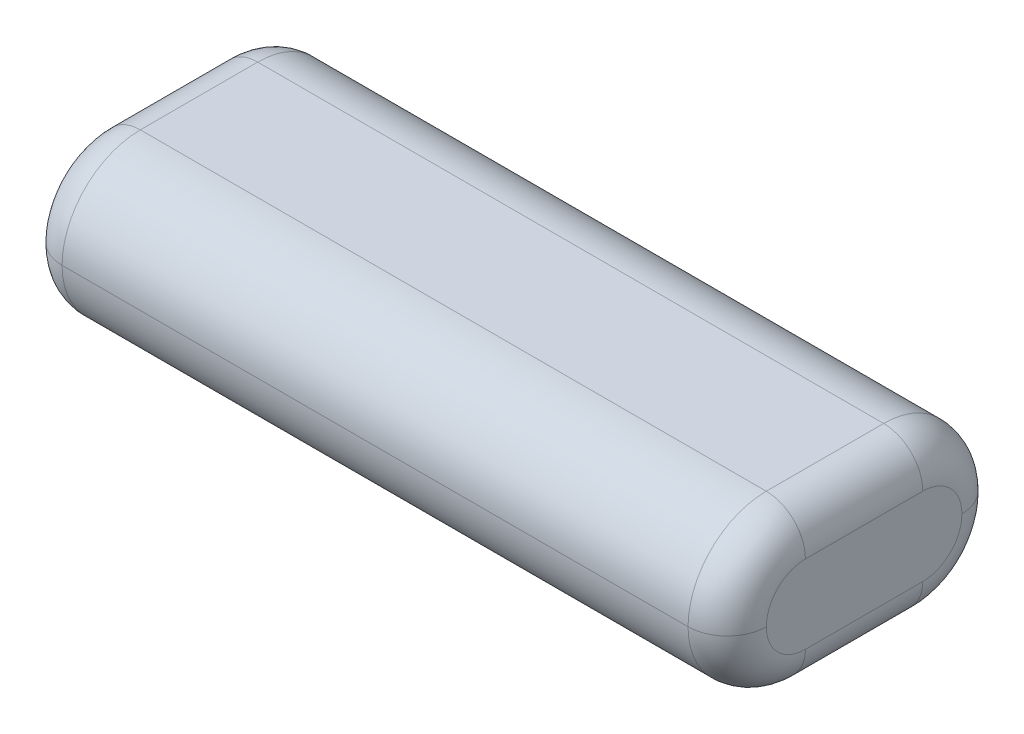
ISO-10303-21;
HEADER;
FILE_DESCRIPTION(('STEP AP214'),'2;1');
FILE_NAME('part.step','',(''),(''),'','','');
FILE_SCHEMA(('AUTOMOTIVE_DESIGN { 1 0 10303 214 1 1 1 1 }'));
ENDSEC;
DATA;
#1=APPLICATION_CONTEXT('core data for automotive mechanical design processes');
#2=APPLICATION_PROTOCOL_DEFINITION('international standard','automotive_design',2000,#1);
#3=PRODUCT_CONTEXT('',#1,'mechanical');
#4=PRODUCT('Part','Part','',(#3));
#5=PRODUCT_RELATED_PRODUCT_CATEGORY('part','',(#4));
#6=PRODUCT_DEFINITION_FORMATION('','',#4);
#7=PRODUCT_DEFINITION_CONTEXT('part definition',#1,'design');
#8=PRODUCT_DEFINITION('design','',#6,#7);
#9=PRODUCT_DEFINITION_SHAPE('','',#8);
#10=(LENGTH_UNIT() NAMED_UNIT(*) SI_UNIT(.MILLI.,.METRE.));
#11=(NAMED_UNIT(*) PLANE_ANGLE_UNIT() SI_UNIT($,.RADIAN.));
#12=(NAMED_UNIT(*) SI_UNIT($,.STERADIAN.) SOLID_ANGLE_UNIT());
#13=UNCERTAINTY_MEASURE_WITH_UNIT(LENGTH_MEASURE(1.E-05),#10,'distance_accuracy_value','');
#14=(GEOMETRIC_REPRESENTATION_CONTEXT(3) GLOBAL_UNCERTAINTY_ASSIGNED_CONTEXT((#13)) GLOBAL_UNIT_ASSIGNED_CONTEXT((#10,
#11,#12)) REPRESENTATION_CONTEXT('',''));
#15=CARTESIAN_POINT('',(0.,0.,0.));
#16=DIRECTION('',(0.,0.,1.));
#17=DIRECTION('',(1.,0.,0.));
#18=AXIS2_PLACEMENT_3D('',#15,#16,#17);
#19=CARTESIAN_POINT('',(0.,20.,0.));
#20=DIRECTION('',(1.,0.,0.));
#21=DIRECTION('',(0.,0.,-1.));
#22=AXIS2_PLACEMENT_3D('',#19,#20,#21);
#23=PLANE('',#22);
#24=DIRECTION('',(0.,0.,1.));
#25=VECTOR('',#24,1.);
#26=CARTESIAN_POINT('',(0.,15.,0.));
#27=LINE('',#26,#25);
#28=CARTESIAN_POINT('',(0.,15.,-10.));
#29=VERTEX_POINT('',#28);
#30=CARTESIAN_POINT('',(0.,15.,-25.));
#31=VERTEX_POINT('',#30);
#32=EDGE_CURVE('E137',#29,#31,#27,.F.);
#33=ORIENTED_EDGE('',*,*,#32,.T.);
#34=CARTESIAN_POINT('',(0.,10.,-25.));
#35=DIRECTION('',(1.,0.,0.));
#36=DIRECTION('',(0.,0.,-1.));
#37=AXIS2_PLACEMENT_3D('',#34,#35,#36);
#38=CIRCLE('',#37,5.);
#39=CARTESIAN_POINT('',(0.,10.,-30.));
#40=VERTEX_POINT('',#39);
#41=EDGE_CURVE('E179',#31,#40,#38,.F.);
#42=ORIENTED_EDGE('',*,*,#41,.T.);
#43=CARTESIAN_POINT('',(0.,10.,-25.));
#44=DIRECTION('',(1.,0.,0.));
#45=DIRECTION('',(0.,0.,-1.));
#46=AXIS2_PLACEMENT_3D('',#43,#44,#45);
#47=CIRCLE('',#46,5.);
#48=CARTESIAN_POINT('',(0.,5.,-25.));
#49=VERTEX_POINT('',#48);
#50=EDGE_CURVE('E176',#40,#49,#47,.F.);
#51=ORIENTED_EDGE('',*,*,#50,.T.);
#52=DIRECTION('',(0.,0.,1.));
#53=VECTOR('',#52,1.);
#54=CARTESIAN_POINT('',(0.,5.,-10.));
#55=LINE('',#54,#53);
#56=CARTESIAN_POINT('',(0.,5.,-10.));
#57=VERTEX_POINT('',#56);
#58=EDGE_CURVE('E173',#49,#57,#55,.T.);
#59=ORIENTED_EDGE('',*,*,#58,.T.);
#60=CARTESIAN_POINT('',(0.,10.,-10.));
#61=DIRECTION('',(1.,0.,0.));
#62=DIRECTION('',(0.,0.,-1.));
#63=AXIS2_PLACEMENT_3D('',#60,#61,#62);
#64=CIRCLE('',#63,5.);
#65=CARTESIAN_POINT('',(0.,10.,-5.));
#66=VERTEX_POINT('',#65);
#67=EDGE_CURVE('E140',#57,#66,#64,.F.);
#68=ORIENTED_EDGE('',*,*,#67,.T.);
#69=CARTESIAN_POINT('',(0.,10.,-10.));
#70=DIRECTION('',(1.,0.,0.));
#71=DIRECTION('',(0.,0.,-1.));
#72=AXIS2_PLACEMENT_3D('',#69,#70,#71);
#73=CIRCLE('',#72,5.);
#74=EDGE_CURVE('E133',#66,#29,#73,.F.);
#75=ORIENTED_EDGE('',*,*,#74,.T.);
#76=EDGE_LOOP('',(#33,#42,#51,#59,#68,#75));
#77=FACE_BOUND('',#76,.T.);
#78=ADVANCED_FACE('F41',(#77),#23,.F.);
#79=CARTESIAN_POINT('',(90.,20.,0.));
#80=DIRECTION('',(-1.,0.,0.));
#81=DIRECTION('',(0.,0.,1.));
#82=AXIS2_PLACEMENT_3D('',#79,#80,#81);
#83=PLANE('',#82);
#84=DIRECTION('',(0.,0.,-1.));
#85=VECTOR('',#84,1.);
#86=CARTESIAN_POINT('',(90.,15.,0.));
#87=LINE('',#86,#85);
#88=CARTESIAN_POINT('',(90.,15.,-25.));
#89=VERTEX_POINT('',#88);
#90=CARTESIAN_POINT('',(90.,15.,-10.));
#91=VERTEX_POINT('',#90);
#92=EDGE_CURVE('E213',#89,#91,#87,.F.);
#93=ORIENTED_EDGE('',*,*,#92,.T.);
#94=CARTESIAN_POINT('',(90.,10.,-10.));
#95=DIRECTION('',(-1.,0.,0.));
#96=DIRECTION('',(0.,0.,1.));
#97=AXIS2_PLACEMENT_3D('',#94,#95,#96);
#98=CIRCLE('',#97,5.);
#99=CARTESIAN_POINT('',(90.,10.,-5.));
#100=VERTEX_POINT('',#99);
#101=EDGE_CURVE('E227',#91,#100,#98,.F.);
#102=ORIENTED_EDGE('',*,*,#101,.T.);
#103=CARTESIAN_POINT('',(90.,10.,-10.));
#104=DIRECTION('',(-1.,0.,0.));
#105=DIRECTION('',(0.,0.,1.));
#106=AXIS2_PLACEMENT_3D('',#103,#104,#105);
#107=CIRCLE('',#106,5.);
#108=CARTESIAN_POINT('',(90.,5.,-10.));
#109=VERTEX_POINT('',#108);
#110=EDGE_CURVE('E66',#100,#109,#107,.F.);
#111=ORIENTED_EDGE('',*,*,#110,.T.);
#112=DIRECTION('',(0.,0.,-1.));
#113=VECTOR('',#112,1.);
#114=CARTESIAN_POINT('',(90.,5.,-25.));
#115=LINE('',#114,#113);
#116=CARTESIAN_POINT('',(90.,5.,-25.));
#117=VERTEX_POINT('',#116);
#118=EDGE_CURVE('E222',#109,#117,#115,.T.);
#119=ORIENTED_EDGE('',*,*,#118,.T.);
#120=CARTESIAN_POINT('',(90.,10.,-25.));
#121=DIRECTION('',(-1.,0.,0.));
#122=DIRECTION('',(0.,0.,1.));
#123=AXIS2_PLACEMENT_3D('',#120,#121,#122);
#124=CIRCLE('',#123,5.);
#125=CARTESIAN_POINT('',(90.,10.,-30.));
#126=VERTEX_POINT('',#125);
#127=EDGE_CURVE('E219',#117,#126,#124,.F.);
#128=ORIENTED_EDGE('',*,*,#127,.T.);
#129=CARTESIAN_POINT('',(90.,10.,-25.));
#130=DIRECTION('',(-1.,0.,0.));
#131=DIRECTION('',(0.,0.,1.));
#132=AXIS2_PLACEMENT_3D('',#129,#130,#131);
#133=CIRCLE('',#132,5.);
#134=EDGE_CURVE('E216',#126,#89,#133,.F.);
#135=ORIENTED_EDGE('',*,*,#134,.T.);
#136=EDGE_LOOP('',(#93,#102,#111,#119,#128,#135));
#137=FACE_BOUND('',#136,.T.);
#138=ADVANCED_FACE('F337',(#137),#83,.F.);
#139=CARTESIAN_POINT('',(0.,20.,0.));
#140=DIRECTION('',(0.,-1.,0.));
#141=DIRECTION('',(0.,0.,-1.));
#142=AXIS2_PLACEMENT_3D('',#139,#140,#141);
#143=PLANE('',#142);
#144=DIRECTION('',(-1.,0.,0.));
#145=VECTOR('',#144,1.);
#146=CARTESIAN_POINT('',(0.,20.,-25.));
#147=LINE('',#146,#145);
#148=CARTESIAN_POINT('',(85.,20.,-25.));
#149=VERTEX_POINT('',#148);
#150=CARTESIAN_POINT('',(5.,20.,-25.));
#151=VERTEX_POINT('',#150);
#152=EDGE_CURVE('E309',#149,#151,#147,.T.);
#153=ORIENTED_EDGE('',*,*,#152,.T.);
#154=DIRECTION('',(0.,0.,1.));
#155=VECTOR('',#154,1.);
#156=CARTESIAN_POINT('',(5.,20.,0.));
#157=LINE('',#156,#155);
#158=CARTESIAN_POINT('',(5.,20.,-10.));
#159=VERTEX_POINT('',#158);
#160=EDGE_CURVE('E11',#151,#159,#157,.T.);
#161=ORIENTED_EDGE('',*,*,#160,.T.);
#162=DIRECTION('',(1.,0.,0.));
#163=VECTOR('',#162,1.);
#164=CARTESIAN_POINT('',(0.,20.,-10.));
#165=LINE('',#164,#163);
#166=CARTESIAN_POINT('',(85.,20.,-10.));
#167=VERTEX_POINT('',#166);
#168=EDGE_CURVE('E302',#159,#167,#165,.T.);
#169=ORIENTED_EDGE('',*,*,#168,.T.);
#170=DIRECTION('',(0.,0.,-1.));
#171=VECTOR('',#170,1.);
#172=CARTESIAN_POINT('',(85.,20.,0.));
#173=LINE('',#172,#171);
#174=EDGE_CURVE('E51',#167,#149,#173,.T.);
#175=ORIENTED_EDGE('',*,*,#174,.T.);
#176=EDGE_LOOP('',(#153,#161,#169,#175));
#177=FACE_BOUND('',#176,.T.);
#178=ADVANCED_FACE('F308',(#177),#143,.F.);
#179=CARTESIAN_POINT('',(0.,0.,0.));
#180=DIRECTION('',(0.,-1.,0.));
#181=DIRECTION('',(0.,0.,-1.));
#182=AXIS2_PLACEMENT_3D('',#179,#180,#181);
#183=PLANE('',#182);
#184=DIRECTION('',(1.,0.,0.));
#185=VECTOR('',#184,1.);
#186=CARTESIAN_POINT('',(0.,0.,-10.));
#187=LINE('',#186,#185);
#188=CARTESIAN_POINT('',(85.,0.,-10.));
#189=VERTEX_POINT('',#188);
#190=CARTESIAN_POINT('',(5.,0.,-10.));
#191=VERTEX_POINT('',#190);
#192=EDGE_CURVE('E165',#189,#191,#187,.F.);
#193=ORIENTED_EDGE('',*,*,#192,.T.);
#194=DIRECTION('',(0.,0.,1.));
#195=VECTOR('',#194,1.);
#196=CARTESIAN_POINT('',(5.,0.,-25.));
#197=LINE('',#196,#195);
#198=CARTESIAN_POINT('',(5.,0.,-25.));
#199=VERTEX_POINT('',#198);
#200=EDGE_CURVE('E198',#191,#199,#197,.F.);
#201=ORIENTED_EDGE('',*,*,#200,.T.);
#202=DIRECTION('',(-1.,0.,0.));
#203=VECTOR('',#202,1.);
#204=CARTESIAN_POINT('',(90.,0.,-25.));
#205=LINE('',#204,#203);
#206=CARTESIAN_POINT('',(85.,0.,-25.));
#207=VERTEX_POINT('',#206);
#208=EDGE_CURVE('E161',#199,#207,#205,.F.);
#209=ORIENTED_EDGE('',*,*,#208,.T.);
#210=DIRECTION('',(0.,0.,-1.));
#211=VECTOR('',#210,1.);
#212=CARTESIAN_POINT('',(85.,0.,-10.));
#213=LINE('',#212,#211);
#214=EDGE_CURVE('E195',#207,#189,#213,.F.);
#215=ORIENTED_EDGE('',*,*,#214,.T.);
#216=EDGE_LOOP('',(#193,#201,#209,#215));
#217=FACE_BOUND('',#216,.T.);
#218=ADVANCED_FACE('F284',(#217),#183,.T.);
#219=CARTESIAN_POINT('',(0.,10.,-25.));
#220=DIRECTION('',(1.,0.,0.));
#221=DIRECTION('',(0.,0.,-1.));
#222=AXIS2_PLACEMENT_3D('',#219,#220,#221);
#223=CYLINDRICAL_SURFACE('',#222,10.);
#224=ORIENTED_EDGE('',*,*,#208,.F.);
#225=CARTESIAN_POINT('',(5.,10.,-25.));
#226=DIRECTION('',(1.,0.,0.));
#227=DIRECTION('',(0.,0.,-1.));
#228=AXIS2_PLACEMENT_3D('',#225,#226,#227);
#229=CIRCLE('',#228,10.);
#230=CARTESIAN_POINT('',(5.,10.,-35.));
#231=VERTEX_POINT('',#230);
#232=EDGE_CURVE('E192',#199,#231,#229,.T.);
#233=ORIENTED_EDGE('',*,*,#232,.T.);
#234=DIRECTION('',(-1.,0.,0.));
#235=VECTOR('',#234,1.);
#236=CARTESIAN_POINT('',(0.,10.,-35.));
#237=LINE('',#236,#235);
#238=CARTESIAN_POINT('',(85.,10.,-35.));
#239=VERTEX_POINT('',#238);
#240=EDGE_CURVE('E281',#239,#231,#237,.T.);
#241=ORIENTED_EDGE('',*,*,#240,.F.);
#242=CARTESIAN_POINT('',(85.,10.,-25.));
#243=DIRECTION('',(-1.,0.,0.));
#244=DIRECTION('',(0.,0.,1.));
#245=AXIS2_PLACEMENT_3D('',#242,#243,#244);
#246=CIRCLE('',#245,10.);
#247=EDGE_CURVE('E189',#239,#207,#246,.T.);
#248=ORIENTED_EDGE('',*,*,#247,.T.);
#249=EDGE_LOOP('',(#224,#233,#241,#248));
#250=FACE_BOUND('',#249,.T.);
#251=ADVANCED_FACE('F278',(#250),#223,.T.);
#252=CARTESIAN_POINT('',(0.,10.,-25.));
#253=DIRECTION('',(-1.,0.,0.));
#254=DIRECTION('',(0.,0.,1.));
#255=AXIS2_PLACEMENT_3D('',#252,#253,#254);
#256=CYLINDRICAL_SURFACE('',#255,10.);
#257=ORIENTED_EDGE('',*,*,#240,.T.);
#258=CARTESIAN_POINT('',(5.,10.,-25.));
#259=DIRECTION('',(1.,0.,0.));
#260=DIRECTION('',(0.,0.,-1.));
#261=AXIS2_PLACEMENT_3D('',#258,#259,#260);
#262=CIRCLE('',#261,10.);
#263=EDGE_CURVE('E185',#231,#151,#262,.T.);
#264=ORIENTED_EDGE('',*,*,#263,.T.);
#265=ORIENTED_EDGE('',*,*,#152,.F.);
#266=CARTESIAN_POINT('',(85.,10.,-25.));
#267=DIRECTION('',(-1.,0.,0.));
#268=DIRECTION('',(0.,0.,1.));
#269=AXIS2_PLACEMENT_3D('',#266,#267,#268);
#270=CIRCLE('',#269,10.);
#271=EDGE_CURVE('E182',#149,#239,#270,.T.);
#272=ORIENTED_EDGE('',*,*,#271,.T.);
#273=EDGE_LOOP('',(#257,#264,#265,#272));
#274=FACE_BOUND('',#273,.T.);
#275=ADVANCED_FACE('F298',(#274),#256,.T.);
#276=CARTESIAN_POINT('',(0.,10.,-10.));
#277=DIRECTION('',(1.,0.,0.));
#278=DIRECTION('',(0.,0.,-1.));
#279=AXIS2_PLACEMENT_3D('',#276,#277,#278);
#280=CYLINDRICAL_SURFACE('',#279,10.);
#281=ORIENTED_EDGE('',*,*,#168,.F.);
#282=CARTESIAN_POINT('',(5.,10.,-10.));
#283=DIRECTION('',(1.,0.,0.));
#284=DIRECTION('',(0.,0.,-1.));
#285=AXIS2_PLACEMENT_3D('',#282,#283,#284);
#286=CIRCLE('',#285,10.);
#287=CARTESIAN_POINT('',(5.,10.,0.));
#288=VERTEX_POINT('',#287);
#289=EDGE_CURVE('E150',#159,#288,#286,.T.);
#290=ORIENTED_EDGE('',*,*,#289,.T.);
#291=DIRECTION('',(1.,0.,0.));
#292=VECTOR('',#291,1.);
#293=CARTESIAN_POINT('',(0.,10.,0.));
#294=LINE('',#293,#292);
#295=CARTESIAN_POINT('',(85.,10.,0.));
#296=VERTEX_POINT('',#295);
#297=EDGE_CURVE('E168',#296,#288,#294,.F.);
#298=ORIENTED_EDGE('',*,*,#297,.F.);
#299=CARTESIAN_POINT('',(85.,10.,-10.));
#300=DIRECTION('',(-1.,0.,0.));
#301=DIRECTION('',(0.,0.,1.));
#302=AXIS2_PLACEMENT_3D('',#299,#300,#301);
#303=CIRCLE('',#302,10.);
#304=EDGE_CURVE('E207',#296,#167,#303,.T.);
#305=ORIENTED_EDGE('',*,*,#304,.T.);
#306=EDGE_LOOP('',(#281,#290,#298,#305));
#307=FACE_BOUND('',#306,.T.);
#308=ADVANCED_FACE('F311',(#307),#280,.T.);
#309=CARTESIAN_POINT('',(0.,10.,-10.));
#310=DIRECTION('',(-1.,0.,0.));
#311=DIRECTION('',(0.,0.,1.));
#312=AXIS2_PLACEMENT_3D('',#309,#310,#311);
#313=CYLINDRICAL_SURFACE('',#312,10.);
#314=ORIENTED_EDGE('',*,*,#297,.T.);
#315=CARTESIAN_POINT('',(5.,10.,-10.));
#316=DIRECTION('',(1.,0.,0.));
#317=DIRECTION('',(0.,0.,-1.));
#318=AXIS2_PLACEMENT_3D('',#315,#316,#317);
#319=CIRCLE('',#318,10.);
#320=EDGE_CURVE('E204',#288,#191,#319,.T.);
#321=ORIENTED_EDGE('',*,*,#320,.T.);
#322=ORIENTED_EDGE('',*,*,#192,.F.);
#323=CARTESIAN_POINT('',(85.,10.,-10.));
#324=DIRECTION('',(-1.,0.,0.));
#325=DIRECTION('',(0.,0.,1.));
#326=AXIS2_PLACEMENT_3D('',#323,#324,#325);
#327=CIRCLE('',#326,10.);
#328=EDGE_CURVE('E201',#189,#296,#327,.T.);
#329=ORIENTED_EDGE('',*,*,#328,.T.);
#330=EDGE_LOOP('',(#314,#321,#322,#329));
#331=FACE_BOUND('',#330,.T.);
#332=ADVANCED_FACE('F323',(#331),#313,.T.);
#333=CARTESIAN_POINT('',(5.,10.,-10.));
#334=DIRECTION('',(1.,0.,0.));
#335=DIRECTION('',(0.,0.,-1.));
#336=AXIS2_PLACEMENT_3D('',#333,#334,#335);
#337=DEGENERATE_TOROIDAL_SURFACE('',#336,5.,5.,.T.);
#338=CARTESIAN_POINT('',(5.,5.,-10.));
#339=DIRECTION('',(0.,0.,-1.));
#340=DIRECTION('',(-1.,0.,0.));
#341=AXIS2_PLACEMENT_3D('',#338,#339,#340);
#342=CIRCLE('',#341,5.);
#343=EDGE_CURVE('E154',#191,#57,#342,.T.);
#344=ORIENTED_EDGE('',*,*,#343,.F.);
#345=ORIENTED_EDGE('',*,*,#320,.F.);
#346=CARTESIAN_POINT('',(5.,10.,-5.));
#347=DIRECTION('',(0.,1.,0.));
#348=DIRECTION('',(0.,0.,1.));
#349=AXIS2_PLACEMENT_3D('',#346,#347,#348);
#350=CIRCLE('',#349,5.);
#351=EDGE_CURVE('E243',#66,#288,#350,.T.);
#352=ORIENTED_EDGE('',*,*,#351,.F.);
#353=ORIENTED_EDGE('',*,*,#67,.F.);
#354=EDGE_LOOP('',(#344,#345,#352,#353));
#355=FACE_BOUND('',#354,.T.);
#356=ADVANCED_FACE('F326',(#355),#337,.T.);
#357=CARTESIAN_POINT('',(5.,10.,-10.));
#358=DIRECTION('',(1.,0.,0.));
#359=DIRECTION('',(0.,0.,-1.));
#360=AXIS2_PLACEMENT_3D('',#357,#358,#359);
#361=DEGENERATE_TOROIDAL_SURFACE('',#360,5.,5.,.T.);
#362=ORIENTED_EDGE('',*,*,#351,.T.);
#363=ORIENTED_EDGE('',*,*,#289,.F.);
#364=CARTESIAN_POINT('',(5.,15.,-10.));
#365=DIRECTION('',(0.,0.,-1.));
#366=DIRECTION('',(-1.,0.,0.));
#367=AXIS2_PLACEMENT_3D('',#364,#365,#366);
#368=CIRCLE('',#367,5.);
#369=EDGE_CURVE('E148',#29,#159,#368,.T.);
#370=ORIENTED_EDGE('',*,*,#369,.F.);
#371=ORIENTED_EDGE('',*,*,#74,.F.);
#372=EDGE_LOOP('',(#362,#363,#370,#371));
#373=FACE_BOUND('',#372,.T.);
#374=ADVANCED_FACE('F149',(#373),#361,.T.);
#375=CARTESIAN_POINT('',(5.,5.,0.));
#376=DIRECTION('',(0.,0.,-1.));
#377=DIRECTION('',(-1.,0.,0.));
#378=AXIS2_PLACEMENT_3D('',#375,#376,#377);
#379=CYLINDRICAL_SURFACE('',#378,5.);
#380=ORIENTED_EDGE('',*,*,#343,.T.);
#381=ORIENTED_EDGE('',*,*,#58,.F.);
#382=CARTESIAN_POINT('',(5.,5.,-25.));
#383=DIRECTION('',(0.,0.,-1.));
#384=DIRECTION('',(-1.,0.,0.));
#385=AXIS2_PLACEMENT_3D('',#382,#383,#384);
#386=CIRCLE('',#385,5.);
#387=EDGE_CURVE('E155',#199,#49,#386,.T.);
#388=ORIENTED_EDGE('',*,*,#387,.F.);
#389=ORIENTED_EDGE('',*,*,#200,.F.);
#390=EDGE_LOOP('',(#380,#381,#388,#389));
#391=FACE_BOUND('',#390,.T.);
#392=ADVANCED_FACE('F289',(#391),#379,.T.);
#393=CARTESIAN_POINT('',(5.,15.,0.));
#394=DIRECTION('',(0.,0.,1.));
#395=DIRECTION('',(1.,0.,0.));
#396=AXIS2_PLACEMENT_3D('',#393,#394,#395);
#397=CYLINDRICAL_SURFACE('',#396,5.);
#398=ORIENTED_EDGE('',*,*,#369,.T.);
#399=ORIENTED_EDGE('',*,*,#160,.F.);
#400=CARTESIAN_POINT('',(5.,15.,-25.));
#401=DIRECTION('',(0.,0.,-1.));
#402=DIRECTION('',(-1.,0.,0.));
#403=AXIS2_PLACEMENT_3D('',#400,#401,#402);
#404=CIRCLE('',#403,5.);
#405=EDGE_CURVE('E158',#31,#151,#404,.T.);
#406=ORIENTED_EDGE('',*,*,#405,.F.);
#407=ORIENTED_EDGE('',*,*,#32,.F.);
#408=EDGE_LOOP('',(#398,#399,#406,#407));
#409=FACE_BOUND('',#408,.T.);
#410=ADVANCED_FACE('F157',(#409),#397,.T.);
#411=CARTESIAN_POINT('',(5.,10.,-25.));
#412=DIRECTION('',(1.,0.,0.));
#413=DIRECTION('',(0.,0.,-1.));
#414=AXIS2_PLACEMENT_3D('',#411,#412,#413);
#415=DEGENERATE_TOROIDAL_SURFACE('',#414,5.,5.,.T.);
#416=ORIENTED_EDGE('',*,*,#387,.T.);
#417=ORIENTED_EDGE('',*,*,#50,.F.);
#418=CARTESIAN_POINT('',(5.,10.,-30.));
#419=DIRECTION('',(0.,1.,0.));
#420=DIRECTION('',(0.,0.,1.));
#421=AXIS2_PLACEMENT_3D('',#418,#419,#420);
#422=CIRCLE('',#421,5.);
#423=EDGE_CURVE('E232',#231,#40,#422,.T.);
#424=ORIENTED_EDGE('',*,*,#423,.F.);
#425=ORIENTED_EDGE('',*,*,#232,.F.);
#426=EDGE_LOOP('',(#416,#417,#424,#425));
#427=FACE_BOUND('',#426,.T.);
#428=ADVANCED_FACE('F295',(#427),#415,.T.);
#429=CARTESIAN_POINT('',(5.,10.,-25.));
#430=DIRECTION('',(1.,0.,0.));
#431=DIRECTION('',(0.,0.,-1.));
#432=AXIS2_PLACEMENT_3D('',#429,#430,#431);
#433=DEGENERATE_TOROIDAL_SURFACE('',#432,5.,5.,.T.);
#434=ORIENTED_EDGE('',*,*,#405,.T.);
#435=ORIENTED_EDGE('',*,*,#263,.F.);
#436=ORIENTED_EDGE('',*,*,#423,.T.);
#437=ORIENTED_EDGE('',*,*,#41,.F.);
#438=EDGE_LOOP('',(#434,#435,#436,#437));
#439=FACE_BOUND('',#438,.T.);
#440=ADVANCED_FACE('F304',(#439),#433,.T.);
#441=CARTESIAN_POINT('',(85.,10.,-25.));
#442=DIRECTION('',(-1.,0.,0.));
#443=DIRECTION('',(0.,0.,1.));
#444=AXIS2_PLACEMENT_3D('',#441,#442,#443);
#445=DEGENERATE_TOROIDAL_SURFACE('',#444,5.,5.,.T.);
#446=CARTESIAN_POINT('',(85.,5.,-25.));
#447=DIRECTION('',(0.,0.,1.));
#448=DIRECTION('',(1.,0.,0.));
#449=AXIS2_PLACEMENT_3D('',#446,#447,#448);
#450=CIRCLE('',#449,5.);
#451=EDGE_CURVE('E258',#207,#117,#450,.T.);
#452=ORIENTED_EDGE('',*,*,#451,.F.);
#453=ORIENTED_EDGE('',*,*,#247,.F.);
#454=CARTESIAN_POINT('',(85.,10.,-30.));
#455=DIRECTION('',(0.,1.,0.));
#456=DIRECTION('',(0.,0.,1.));
#457=AXIS2_PLACEMENT_3D('',#454,#455,#456);
#458=CIRCLE('',#457,5.);
#459=EDGE_CURVE('E45',#126,#239,#458,.T.);
#460=ORIENTED_EDGE('',*,*,#459,.F.);
#461=ORIENTED_EDGE('',*,*,#127,.F.);
#462=EDGE_LOOP('',(#452,#453,#460,#461));
#463=FACE_BOUND('',#462,.T.);
#464=ADVANCED_FACE('F43',(#463),#445,.T.);
#465=CARTESIAN_POINT('',(85.,10.,-25.));
#466=DIRECTION('',(-1.,0.,0.));
#467=DIRECTION('',(0.,0.,1.));
#468=AXIS2_PLACEMENT_3D('',#465,#466,#467);
#469=DEGENERATE_TOROIDAL_SURFACE('',#468,5.,5.,.T.);
#470=ORIENTED_EDGE('',*,*,#459,.T.);
#471=ORIENTED_EDGE('',*,*,#271,.F.);
#472=CARTESIAN_POINT('',(85.,15.,-25.));
#473=DIRECTION('',(0.,0.,1.));
#474=DIRECTION('',(1.,0.,0.));
#475=AXIS2_PLACEMENT_3D('',#472,#473,#474);
#476=CIRCLE('',#475,5.);
#477=EDGE_CURVE('E255',#89,#149,#476,.T.);
#478=ORIENTED_EDGE('',*,*,#477,.F.);
#479=ORIENTED_EDGE('',*,*,#134,.F.);
#480=EDGE_LOOP('',(#470,#471,#478,#479));
#481=FACE_BOUND('',#480,.T.);
#482=ADVANCED_FACE('F270',(#481),#469,.T.);
#483=CARTESIAN_POINT('',(85.,5.,0.));
#484=DIRECTION('',(0.,0.,1.));
#485=DIRECTION('',(1.,0.,0.));
#486=AXIS2_PLACEMENT_3D('',#483,#484,#485);
#487=CYLINDRICAL_SURFACE('',#486,5.);
#488=ORIENTED_EDGE('',*,*,#451,.T.);
#489=ORIENTED_EDGE('',*,*,#118,.F.);
#490=CARTESIAN_POINT('',(85.,5.,-10.));
#491=DIRECTION('',(0.,0.,1.));
#492=DIRECTION('',(1.,0.,0.));
#493=AXIS2_PLACEMENT_3D('',#490,#491,#492);
#494=CIRCLE('',#493,5.);
#495=EDGE_CURVE('E251',#189,#109,#494,.T.);
#496=ORIENTED_EDGE('',*,*,#495,.F.);
#497=ORIENTED_EDGE('',*,*,#214,.F.);
#498=EDGE_LOOP('',(#488,#489,#496,#497));
#499=FACE_BOUND('',#498,.T.);
#500=ADVANCED_FACE('F385',(#499),#487,.T.);
#501=CARTESIAN_POINT('',(85.,15.,0.));
#502=DIRECTION('',(0.,0.,-1.));
#503=DIRECTION('',(-1.,0.,0.));
#504=AXIS2_PLACEMENT_3D('',#501,#502,#503);
#505=CYLINDRICAL_SURFACE('',#504,5.);
#506=ORIENTED_EDGE('',*,*,#477,.T.);
#507=ORIENTED_EDGE('',*,*,#174,.F.);
#508=CARTESIAN_POINT('',(85.,15.,-10.));
#509=DIRECTION('',(0.,0.,1.));
#510=DIRECTION('',(1.,0.,0.));
#511=AXIS2_PLACEMENT_3D('',#508,#509,#510);
#512=CIRCLE('',#511,5.);
#513=EDGE_CURVE('E248',#91,#167,#512,.T.);
#514=ORIENTED_EDGE('',*,*,#513,.F.);
#515=ORIENTED_EDGE('',*,*,#92,.F.);
#516=EDGE_LOOP('',(#506,#507,#514,#515));
#517=FACE_BOUND('',#516,.T.);
#518=ADVANCED_FACE('F391',(#517),#505,.T.);
#519=CARTESIAN_POINT('',(85.,10.,-10.));
#520=DIRECTION('',(-1.,0.,0.));
#521=DIRECTION('',(0.,0.,1.));
#522=AXIS2_PLACEMENT_3D('',#519,#520,#521);
#523=DEGENERATE_TOROIDAL_SURFACE('',#522,5.,5.,.T.);
#524=ORIENTED_EDGE('',*,*,#495,.T.);
#525=ORIENTED_EDGE('',*,*,#110,.F.);
#526=CARTESIAN_POINT('',(85.,10.,-5.));
#527=DIRECTION('',(0.,1.,0.));
#528=DIRECTION('',(0.,0.,1.));
#529=AXIS2_PLACEMENT_3D('',#526,#527,#528);
#530=CIRCLE('',#529,5.);
#531=EDGE_CURVE('E59',#296,#100,#530,.T.);
#532=ORIENTED_EDGE('',*,*,#531,.F.);
#533=ORIENTED_EDGE('',*,*,#328,.F.);
#534=EDGE_LOOP('',(#524,#525,#532,#533));
#535=FACE_BOUND('',#534,.T.);
#536=ADVANCED_FACE('F398',(#535),#523,.T.);
#537=CARTESIAN_POINT('',(85.,10.,-10.));
#538=DIRECTION('',(-1.,0.,0.));
#539=DIRECTION('',(0.,0.,1.));
#540=AXIS2_PLACEMENT_3D('',#537,#538,#539);
#541=DEGENERATE_TOROIDAL_SURFACE('',#540,5.,5.,.T.);
#542=ORIENTED_EDGE('',*,*,#513,.T.);
#543=ORIENTED_EDGE('',*,*,#304,.F.);
#544=ORIENTED_EDGE('',*,*,#531,.T.);
#545=ORIENTED_EDGE('',*,*,#101,.F.);
#546=EDGE_LOOP('',(#542,#543,#544,#545));
#547=FACE_BOUND('',#546,.T.);
#548=ADVANCED_FACE('F406',(#547),#541,.T.);
#549=CLOSED_SHELL('',(#78,#138,#178,#218,#251,#275,#308,#332,#356,#374,#392,#410,#428,#440,#464,
#482,#500,#518,#536,#548));
#550=MANIFOLD_SOLID_BREP('B2',#549);
#551=ADVANCED_BREP_SHAPE_REPRESENTATION('',(#18,#550),#14);
#552=SHAPE_DEFINITION_REPRESENTATION(#9,#551);
ENDSEC;
END-ISO-10303-21;
